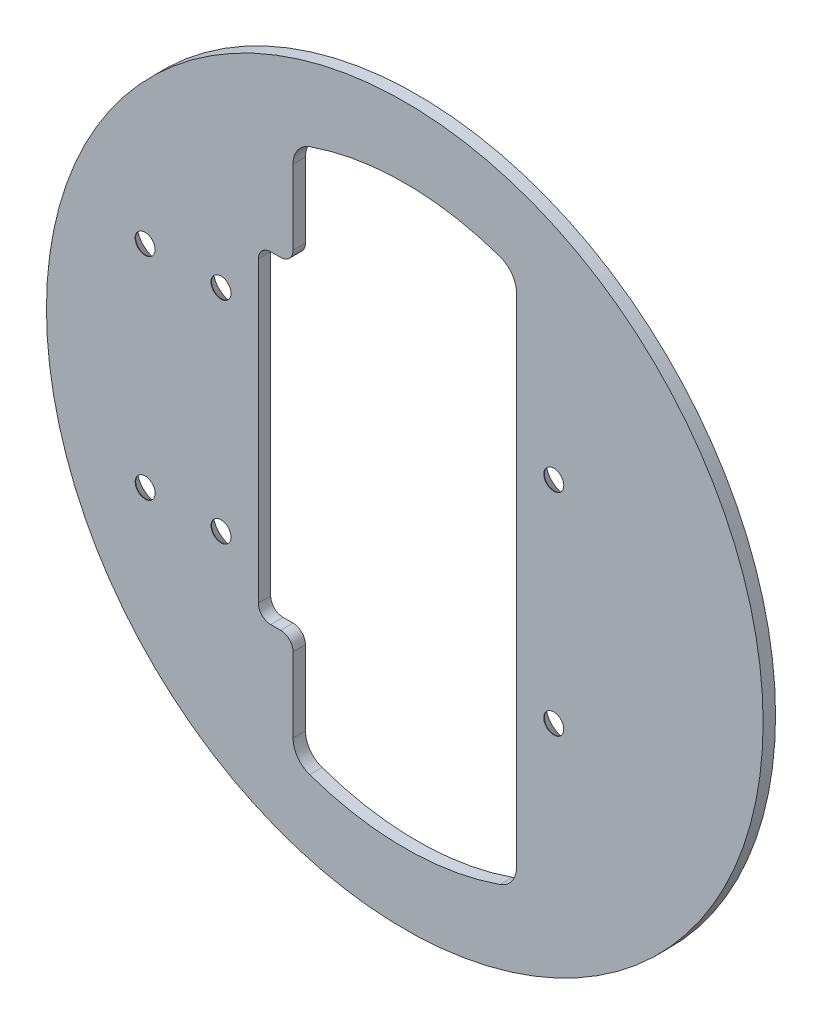
ISO-10303-21;
HEADER;
FILE_DESCRIPTION(('STEP AP214'),'2;1');
FILE_NAME('part.step','',(''),(''),'','','');
FILE_SCHEMA(('AUTOMOTIVE_DESIGN { 1 0 10303 214 1 1 1 1 }'));
ENDSEC;
DATA;
#1=APPLICATION_CONTEXT('core data for automotive mechanical design processes');
#2=APPLICATION_PROTOCOL_DEFINITION('international standard','automotive_design',2000,#1);
#3=PRODUCT_CONTEXT('',#1,'mechanical');
#4=PRODUCT('Part','Part','',(#3));
#5=PRODUCT_RELATED_PRODUCT_CATEGORY('part','',(#4));
#6=PRODUCT_DEFINITION_FORMATION('','',#4);
#7=PRODUCT_DEFINITION_CONTEXT('part definition',#1,'design');
#8=PRODUCT_DEFINITION('design','',#6,#7);
#9=PRODUCT_DEFINITION_SHAPE('','',#8);
#10=(LENGTH_UNIT() NAMED_UNIT(*) SI_UNIT(.MILLI.,.METRE.));
#11=(NAMED_UNIT(*) PLANE_ANGLE_UNIT() SI_UNIT($,.RADIAN.));
#12=(NAMED_UNIT(*) SI_UNIT($,.STERADIAN.) SOLID_ANGLE_UNIT());
#13=UNCERTAINTY_MEASURE_WITH_UNIT(LENGTH_MEASURE(1.E-05),#10,'distance_accuracy_value','');
#14=(GEOMETRIC_REPRESENTATION_CONTEXT(3) GLOBAL_UNCERTAINTY_ASSIGNED_CONTEXT((#13)) GLOBAL_UNIT_ASSIGNED_CONTEXT((#10,
#11,#12)) REPRESENTATION_CONTEXT('',''));
#15=CARTESIAN_POINT('',(0.,0.,0.));
#16=DIRECTION('',(0.,0.,1.));
#17=DIRECTION('',(1.,0.,0.));
#18=AXIS2_PLACEMENT_3D('',#15,#16,#17);
#19=CARTESIAN_POINT('',(0.,25.4,0.));
#20=DIRECTION('',(0.,0.,-1.));
#21=DIRECTION('',(-1.,0.,0.));
#22=AXIS2_PLACEMENT_3D('',#19,#20,#21);
#23=PLANE('',#22);
#24=CARTESIAN_POINT('',(0.,25.4,0.));
#25=DIRECTION('',(0.,0.,1.));
#26=DIRECTION('',(1.,0.,0.));
#27=AXIS2_PLACEMENT_3D('',#24,#25,#26);
#28=CIRCLE('',#27,73.66);
#29=CARTESIAN_POINT('',(-24.3216981132075,-44.1287753443853,0.));
#30=VERTEX_POINT('',#29);
#31=CARTESIAN_POINT('',(24.3216981132076,-44.1287753443853,0.));
#32=VERTEX_POINT('',#31);
#33=EDGE_CURVE('E230',#30,#32,#28,.T.);
#34=ORIENTED_EDGE('',*,*,#33,.T.);
#35=CARTESIAN_POINT('',(22.225,-38.1349154009038,0.));
#36=DIRECTION('',(0.,0.,1.));
#37=DIRECTION('',(1.,0.,0.));
#38=AXIS2_PLACEMENT_3D('',#35,#36,#37);
#39=CIRCLE('',#38,6.35);
#40=CARTESIAN_POINT('',(28.575,-38.1349154009038,0.));
#41=VERTEX_POINT('',#40);
#42=EDGE_CURVE('E148',#32,#41,#39,.T.);
#43=ORIENTED_EDGE('',*,*,#42,.T.);
#44=DIRECTION('',(0.,1.,0.));
#45=VECTOR('',#44,1.);
#46=CARTESIAN_POINT('',(28.575,-28.448,0.));
#47=LINE('',#46,#45);
#48=CARTESIAN_POINT('',(28.575,88.9349154009038,0.));
#49=VERTEX_POINT('',#48);
#50=EDGE_CURVE('E142',#41,#49,#47,.T.);
#51=ORIENTED_EDGE('',*,*,#50,.T.);
#52=CARTESIAN_POINT('',(22.225,88.9349154009038,0.));
#53=DIRECTION('',(0.,0.,1.));
#54=DIRECTION('',(1.,0.,0.));
#55=AXIS2_PLACEMENT_3D('',#52,#53,#54);
#56=CIRCLE('',#55,6.35);
#57=CARTESIAN_POINT('',(24.3216981132075,94.9287753443853,0.));
#58=VERTEX_POINT('',#57);
#59=EDGE_CURVE('E130',#49,#58,#56,.T.);
#60=ORIENTED_EDGE('',*,*,#59,.T.);
#61=CARTESIAN_POINT('',(0.,25.4,0.));
#62=DIRECTION('',(0.,0.,1.));
#63=DIRECTION('',(1.,0.,0.));
#64=AXIS2_PLACEMENT_3D('',#61,#62,#63);
#65=CIRCLE('',#64,73.66);
#66=CARTESIAN_POINT('',(-24.3216981132075,94.9287753443853,0.));
#67=VERTEX_POINT('',#66);
#68=EDGE_CURVE('E246',#58,#67,#65,.T.);
#69=ORIENTED_EDGE('',*,*,#68,.T.);
#70=CARTESIAN_POINT('',(-22.225,88.9349154009038,0.));
#71=DIRECTION('',(0.,0.,1.));
#72=DIRECTION('',(1.,0.,0.));
#73=AXIS2_PLACEMENT_3D('',#70,#71,#72);
#74=CIRCLE('',#73,6.35);
#75=CARTESIAN_POINT('',(-28.575,88.9349154009038,0.));
#76=VERTEX_POINT('',#75);
#77=EDGE_CURVE('E243',#67,#76,#74,.T.);
#78=ORIENTED_EDGE('',*,*,#77,.T.);
#79=DIRECTION('',(0.,1.,0.));
#80=VECTOR('',#79,1.);
#81=CARTESIAN_POINT('',(-28.575,69.8627,0.));
#82=LINE('',#81,#80);
#83=CARTESIAN_POINT('',(-28.575,69.8627,0.));
#84=VERTEX_POINT('',#83);
#85=EDGE_CURVE('E171',#76,#84,#82,.F.);
#86=ORIENTED_EDGE('',*,*,#85,.T.);
#87=CARTESIAN_POINT('',(-31.75,69.8627,0.));
#88=DIRECTION('',(0.,0.,1.));
#89=DIRECTION('',(1.,0.,0.));
#90=AXIS2_PLACEMENT_3D('',#87,#88,#89);
#91=CIRCLE('',#90,3.175);
#92=CARTESIAN_POINT('',(-31.75,66.6877,0.));
#93=VERTEX_POINT('',#92);
#94=EDGE_CURVE('E173',#93,#84,#91,.T.);
#95=ORIENTED_EDGE('',*,*,#94,.F.);
#96=DIRECTION('',(1.,0.,0.));
#97=VECTOR('',#96,1.);
#98=CARTESIAN_POINT('',(-34.29,66.6877,0.));
#99=LINE('',#98,#97);
#100=CARTESIAN_POINT('',(-34.29,66.6877,0.));
#101=VERTEX_POINT('',#100);
#102=EDGE_CURVE('E167',#93,#101,#99,.F.);
#103=ORIENTED_EDGE('',*,*,#102,.T.);
#104=CARTESIAN_POINT('',(-34.29,63.5127,0.));
#105=DIRECTION('',(0.,0.,1.));
#106=DIRECTION('',(1.,0.,0.));
#107=AXIS2_PLACEMENT_3D('',#104,#105,#106);
#108=CIRCLE('',#107,3.175);
#109=CARTESIAN_POINT('',(-37.465,63.5127,0.));
#110=VERTEX_POINT('',#109);
#111=EDGE_CURVE('E239',#101,#110,#108,.T.);
#112=ORIENTED_EDGE('',*,*,#111,.T.);
#113=DIRECTION('',(0.,1.,0.));
#114=VECTOR('',#113,1.);
#115=CARTESIAN_POINT('',(-37.465,-12.7,0.));
#116=LINE('',#115,#114);
#117=CARTESIAN_POINT('',(-37.465,-12.7,0.));
#118=VERTEX_POINT('',#117);
#119=EDGE_CURVE('E163',#110,#118,#116,.F.);
#120=ORIENTED_EDGE('',*,*,#119,.T.);
#121=CARTESIAN_POINT('',(-34.29,-12.7,0.));
#122=DIRECTION('',(0.,0.,1.));
#123=DIRECTION('',(1.,0.,0.));
#124=AXIS2_PLACEMENT_3D('',#121,#122,#123);
#125=CIRCLE('',#124,3.17499999999997);
#126=CARTESIAN_POINT('',(-34.29,-15.875,0.));
#127=VERTEX_POINT('',#126);
#128=EDGE_CURVE('E237',#118,#127,#125,.T.);
#129=ORIENTED_EDGE('',*,*,#128,.T.);
#130=DIRECTION('',(1.,0.,0.));
#131=VECTOR('',#130,1.);
#132=CARTESIAN_POINT('',(-31.75,-15.875,0.));
#133=LINE('',#132,#131);
#134=CARTESIAN_POINT('',(-31.75,-15.875,0.));
#135=VERTEX_POINT('',#134);
#136=EDGE_CURVE('E158',#127,#135,#133,.T.);
#137=ORIENTED_EDGE('',*,*,#136,.T.);
#138=CARTESIAN_POINT('',(-31.75,-19.05,0.));
#139=DIRECTION('',(0.,0.,1.));
#140=DIRECTION('',(1.,0.,0.));
#141=AXIS2_PLACEMENT_3D('',#138,#139,#140);
#142=CIRCLE('',#141,3.175);
#143=CARTESIAN_POINT('',(-28.5749999999999,-19.05,0.));
#144=VERTEX_POINT('',#143);
#145=EDGE_CURVE('E161',#144,#135,#142,.T.);
#146=ORIENTED_EDGE('',*,*,#145,.F.);
#147=DIRECTION('',(0.,1.,0.));
#148=VECTOR('',#147,1.);
#149=CARTESIAN_POINT('',(-28.5749999999999,-38.1349154009038,0.));
#150=LINE('',#149,#148);
#151=CARTESIAN_POINT('',(-28.5749999999999,-38.1349154009038,0.));
#152=VERTEX_POINT('',#151);
#153=EDGE_CURVE('E154',#144,#152,#150,.F.);
#154=ORIENTED_EDGE('',*,*,#153,.T.);
#155=CARTESIAN_POINT('',(-22.2249999999999,-38.1349154009038,0.));
#156=DIRECTION('',(0.,0.,1.));
#157=DIRECTION('',(1.,0.,0.));
#158=AXIS2_PLACEMENT_3D('',#155,#156,#157);
#159=CIRCLE('',#158,6.35);
#160=EDGE_CURVE('E233',#152,#30,#159,.T.);
#161=ORIENTED_EDGE('',*,*,#160,.T.);
#162=EDGE_LOOP('',(#34,#43,#51,#60,#69,#78,#86,#95,#103,#112,#120,#129,#137,#146,#154,#161));
#163=FACE_BOUND('',#162,.T.);
#164=CARTESIAN_POINT('',(38.1,-1.5875,0.));
#165=DIRECTION('',(0.,0.,-1.));
#166=DIRECTION('',(-1.,0.,0.));
#167=AXIS2_PLACEMENT_3D('',#164,#165,#166);
#168=CIRCLE('',#167,5.207);
#169=CARTESIAN_POINT('',(32.893,-1.5875,0.));
#170=VERTEX_POINT('',#169);
#171=EDGE_CURVE('E253',#170,#170,#168,.F.);
#172=ORIENTED_EDGE('',*,*,#171,.T.);
#173=EDGE_LOOP('',(#172));
#174=FACE_BOUND('',#173,.T.);
#175=CARTESIAN_POINT('',(38.1,52.3875,0.));
#176=DIRECTION('',(0.,0.,-1.));
#177=DIRECTION('',(-1.,0.,0.));
#178=AXIS2_PLACEMENT_3D('',#175,#176,#177);
#179=CIRCLE('',#178,5.207);
#180=CARTESIAN_POINT('',(32.893,52.3875,0.));
#181=VERTEX_POINT('',#180);
#182=EDGE_CURVE('E250',#181,#181,#179,.F.);
#183=ORIENTED_EDGE('',*,*,#182,.T.);
#184=EDGE_LOOP('',(#183));
#185=FACE_BOUND('',#184,.T.);
#186=CARTESIAN_POINT('',(-46.99,-1.58750000000003,0.));
#187=DIRECTION('',(0.,0.,-1.));
#188=DIRECTION('',(-1.,0.,0.));
#189=AXIS2_PLACEMENT_3D('',#186,#187,#188);
#190=CIRCLE('',#189,5.207);
#191=CARTESIAN_POINT('',(-52.197,-1.58750000000003,0.));
#192=VERTEX_POINT('',#191);
#193=EDGE_CURVE('E256',#192,#192,#190,.F.);
#194=ORIENTED_EDGE('',*,*,#193,.T.);
#195=EDGE_LOOP('',(#194));
#196=FACE_BOUND('',#195,.T.);
#197=CARTESIAN_POINT('',(-46.99,52.3875,0.));
#198=DIRECTION('',(0.,0.,-1.));
#199=DIRECTION('',(-1.,0.,0.));
#200=AXIS2_PLACEMENT_3D('',#197,#198,#199);
#201=CIRCLE('',#200,5.207);
#202=CARTESIAN_POINT('',(-52.197,52.3875,0.));
#203=VERTEX_POINT('',#202);
#204=EDGE_CURVE('E259',#203,#203,#201,.F.);
#205=ORIENTED_EDGE('',*,*,#204,.T.);
#206=EDGE_LOOP('',(#205));
#207=FACE_BOUND('',#206,.T.);
#208=CARTESIAN_POINT('',(-66.3956,52.3875,0.));
#209=DIRECTION('',(0.,0.,-1.));
#210=DIRECTION('',(-1.,0.,0.));
#211=AXIS2_PLACEMENT_3D('',#208,#209,#210);
#212=CIRCLE('',#211,5.20699999999998);
#213=CARTESIAN_POINT('',(-71.6026,52.3875,0.));
#214=VERTEX_POINT('',#213);
#215=EDGE_CURVE('E261',#214,#214,#212,.F.);
#216=ORIENTED_EDGE('',*,*,#215,.T.);
#217=EDGE_LOOP('',(#216));
#218=FACE_BOUND('',#217,.T.);
#219=CARTESIAN_POINT('',(-66.3956,-1.5875,0.));
#220=DIRECTION('',(0.,0.,-1.));
#221=DIRECTION('',(-1.,0.,0.));
#222=AXIS2_PLACEMENT_3D('',#219,#220,#221);
#223=CIRCLE('',#222,5.20699999999998);
#224=CARTESIAN_POINT('',(-71.6026,-1.5875,0.));
#225=VERTEX_POINT('',#224);
#226=EDGE_CURVE('E21',#225,#225,#223,.F.);
#227=ORIENTED_EDGE('',*,*,#226,.T.);
#228=EDGE_LOOP('',(#227));
#229=FACE_BOUND('',#228,.T.);
#230=CARTESIAN_POINT('',(0.,25.4,0.));
#231=DIRECTION('',(0.,0.,1.));
#232=DIRECTION('',(1.,0.,0.));
#233=AXIS2_PLACEMENT_3D('',#230,#231,#232);
#234=CIRCLE('',#233,91.6305);
#235=CARTESIAN_POINT('',(91.6305,25.4,0.));
#236=VERTEX_POINT('',#235);
#237=EDGE_CURVE('E139',#236,#236,#234,.T.);
#238=ORIENTED_EDGE('',*,*,#237,.F.);
#239=EDGE_LOOP('',(#238));
#240=FACE_BOUND('',#239,.T.);
#241=ADVANCED_FACE('F17',(#163,#174,#185,#196,#207,#218,#229,#240),#23,.T.);
#242=CARTESIAN_POINT('',(-66.3956,-1.5875,0.));
#243=DIRECTION('',(0.,0.,-1.));
#244=DIRECTION('',(-1.,0.,0.));
#245=AXIS2_PLACEMENT_3D('',#242,#243,#244);
#246=CONICAL_SURFACE('',#245,5.207,0.715584993317677);
#247=CARTESIAN_POINT('',(-66.3956,-1.5875,3.05342286328671));
#248=DIRECTION('',(0.,0.,1.));
#249=DIRECTION('',(1.,0.,0.));
#250=AXIS2_PLACEMENT_3D('',#247,#248,#249);
#251=CIRCLE('',#250,2.5527);
#252=CARTESIAN_POINT('',(-63.8429,-1.5875,3.05342286328671));
#253=VERTEX_POINT('',#252);
#254=EDGE_CURVE('E144',#253,#253,#251,.T.);
#255=ORIENTED_EDGE('',*,*,#254,.T.);
#256=EDGE_LOOP('',(#255));
#257=FACE_BOUND('',#256,.T.);
#258=ORIENTED_EDGE('',*,*,#226,.F.);
#259=EDGE_LOOP('',(#258));
#260=FACE_BOUND('',#259,.T.);
#261=ADVANCED_FACE('F270',(#257,#260),#246,.F.);
#262=CARTESIAN_POINT('',(-66.3956,52.3875,0.));
#263=DIRECTION('',(0.,0.,-1.));
#264=DIRECTION('',(-1.,0.,0.));
#265=AXIS2_PLACEMENT_3D('',#262,#263,#264);
#266=CONICAL_SURFACE('',#265,5.207,0.715584993317677);
#267=CARTESIAN_POINT('',(-66.3956,52.3875,3.05342286328671));
#268=DIRECTION('',(0.,0.,1.));
#269=DIRECTION('',(1.,0.,0.));
#270=AXIS2_PLACEMENT_3D('',#267,#268,#269);
#271=CIRCLE('',#270,2.5527);
#272=CARTESIAN_POINT('',(-63.8429,52.3875,3.05342286328671));
#273=VERTEX_POINT('',#272);
#274=EDGE_CURVE('E418',#273,#273,#271,.T.);
#275=ORIENTED_EDGE('',*,*,#274,.T.);
#276=EDGE_LOOP('',(#275));
#277=FACE_BOUND('',#276,.T.);
#278=ORIENTED_EDGE('',*,*,#215,.F.);
#279=EDGE_LOOP('',(#278));
#280=FACE_BOUND('',#279,.T.);
#281=ADVANCED_FACE('F272',(#277,#280),#266,.F.);
#282=CARTESIAN_POINT('',(-46.99,52.3875,0.));
#283=DIRECTION('',(0.,0.,-1.));
#284=DIRECTION('',(-1.,0.,0.));
#285=AXIS2_PLACEMENT_3D('',#282,#283,#284);
#286=CONICAL_SURFACE('',#285,5.207,0.715584993317677);
#287=CARTESIAN_POINT('',(-46.99,52.3875,3.05342286328671));
#288=DIRECTION('',(0.,0.,1.));
#289=DIRECTION('',(1.,0.,0.));
#290=AXIS2_PLACEMENT_3D('',#287,#288,#289);
#291=CIRCLE('',#290,2.5527);
#292=CARTESIAN_POINT('',(-44.4373,52.3875,3.05342286328671));
#293=VERTEX_POINT('',#292);
#294=EDGE_CURVE('E415',#293,#293,#291,.T.);
#295=ORIENTED_EDGE('',*,*,#294,.T.);
#296=EDGE_LOOP('',(#295));
#297=FACE_BOUND('',#296,.T.);
#298=ORIENTED_EDGE('',*,*,#204,.F.);
#299=EDGE_LOOP('',(#298));
#300=FACE_BOUND('',#299,.T.);
#301=ADVANCED_FACE('F280',(#297,#300),#286,.F.);
#302=CARTESIAN_POINT('',(-46.99,-1.58750000000003,0.));
#303=DIRECTION('',(0.,0.,-1.));
#304=DIRECTION('',(-1.,0.,0.));
#305=AXIS2_PLACEMENT_3D('',#302,#303,#304);
#306=CONICAL_SURFACE('',#305,5.207,0.715584993317677);
#307=CARTESIAN_POINT('',(-46.99,-1.58750000000003,3.05342286328671));
#308=DIRECTION('',(0.,0.,1.));
#309=DIRECTION('',(1.,0.,0.));
#310=AXIS2_PLACEMENT_3D('',#307,#308,#309);
#311=CIRCLE('',#310,2.5527);
#312=CARTESIAN_POINT('',(-44.4373,-1.58750000000003,3.05342286328671));
#313=VERTEX_POINT('',#312);
#314=EDGE_CURVE('E417',#313,#313,#311,.T.);
#315=ORIENTED_EDGE('',*,*,#314,.T.);
#316=EDGE_LOOP('',(#315));
#317=FACE_BOUND('',#316,.T.);
#318=ORIENTED_EDGE('',*,*,#193,.F.);
#319=EDGE_LOOP('',(#318));
#320=FACE_BOUND('',#319,.T.);
#321=ADVANCED_FACE('F393',(#317,#320),#306,.F.);
#322=CARTESIAN_POINT('',(38.1,-1.5875,0.));
#323=DIRECTION('',(0.,0.,-1.));
#324=DIRECTION('',(-1.,0.,0.));
#325=AXIS2_PLACEMENT_3D('',#322,#323,#324);
#326=CONICAL_SURFACE('',#325,5.207,0.715584993317677);
#327=CARTESIAN_POINT('',(38.1,-1.5875,3.05342286328671));
#328=DIRECTION('',(0.,0.,1.));
#329=DIRECTION('',(1.,0.,0.));
#330=AXIS2_PLACEMENT_3D('',#327,#328,#329);
#331=CIRCLE('',#330,2.5527);
#332=CARTESIAN_POINT('',(40.6527,-1.5875,3.05342286328671));
#333=VERTEX_POINT('',#332);
#334=EDGE_CURVE('E421',#333,#333,#331,.T.);
#335=ORIENTED_EDGE('',*,*,#334,.T.);
#336=EDGE_LOOP('',(#335));
#337=FACE_BOUND('',#336,.T.);
#338=ORIENTED_EDGE('',*,*,#171,.F.);
#339=EDGE_LOOP('',(#338));
#340=FACE_BOUND('',#339,.T.);
#341=ADVANCED_FACE('F384',(#337,#340),#326,.F.);
#342=CARTESIAN_POINT('',(38.1,52.3875,0.));
#343=DIRECTION('',(0.,0.,-1.));
#344=DIRECTION('',(-1.,0.,0.));
#345=AXIS2_PLACEMENT_3D('',#342,#343,#344);
#346=CONICAL_SURFACE('',#345,5.207,0.715584993317677);
#347=CARTESIAN_POINT('',(38.1,52.3875,3.05342286328671));
#348=DIRECTION('',(0.,0.,1.));
#349=DIRECTION('',(1.,0.,0.));
#350=AXIS2_PLACEMENT_3D('',#347,#348,#349);
#351=CIRCLE('',#350,2.5527);
#352=CARTESIAN_POINT('',(40.6527,52.3875,3.05342286328671));
#353=VERTEX_POINT('',#352);
#354=EDGE_CURVE('E227',#353,#353,#351,.T.);
#355=ORIENTED_EDGE('',*,*,#354,.T.);
#356=EDGE_LOOP('',(#355));
#357=FACE_BOUND('',#356,.T.);
#358=ORIENTED_EDGE('',*,*,#182,.F.);
#359=EDGE_LOOP('',(#358));
#360=FACE_BOUND('',#359,.T.);
#361=ADVANCED_FACE('F19',(#357,#360),#346,.F.);
#362=CARTESIAN_POINT('',(0.,25.4,0.));
#363=DIRECTION('',(0.,0.,1.));
#364=DIRECTION('',(1.,0.,0.));
#365=AXIS2_PLACEMENT_3D('',#362,#363,#364);
#366=CYLINDRICAL_SURFACE('',#365,91.6305);
#367=ORIENTED_EDGE('',*,*,#237,.T.);
#368=EDGE_LOOP('',(#367));
#369=FACE_BOUND('',#368,.T.);
#370=CARTESIAN_POINT('',(0.,25.4,3.175));
#371=DIRECTION('',(0.,0.,1.));
#372=DIRECTION('',(1.,0.,0.));
#373=AXIS2_PLACEMENT_3D('',#370,#371,#372);
#374=CIRCLE('',#373,91.6305);
#375=CARTESIAN_POINT('',(91.6305,25.4,3.175));
#376=VERTEX_POINT('',#375);
#377=EDGE_CURVE('E224',#376,#376,#374,.F.);
#378=ORIENTED_EDGE('',*,*,#377,.T.);
#379=EDGE_LOOP('',(#378));
#380=FACE_BOUND('',#379,.T.);
#381=ADVANCED_FACE('F378',(#369,#380),#366,.T.);
#382=CARTESIAN_POINT('',(22.225,88.9349154009038,0.));
#383=DIRECTION('',(0.,0.,1.));
#384=DIRECTION('',(1.,0.,0.));
#385=AXIS2_PLACEMENT_3D('',#382,#383,#384);
#386=CYLINDRICAL_SURFACE('',#385,6.35);
#387=DIRECTION('',(0.,0.,1.));
#388=VECTOR('',#387,1.);
#389=CARTESIAN_POINT('',(24.3216981132075,94.9287753443853,0.));
#390=LINE('',#389,#388);
#391=CARTESIAN_POINT('',(24.3216981132075,94.9287753443853,3.175));
#392=VERTEX_POINT('',#391);
#393=EDGE_CURVE('E135',#392,#58,#390,.F.);
#394=ORIENTED_EDGE('',*,*,#393,.T.);
#395=ORIENTED_EDGE('',*,*,#59,.F.);
#396=DIRECTION('',(0.,0.,-1.));
#397=VECTOR('',#396,1.);
#398=CARTESIAN_POINT('',(28.575,88.9349154009038,0.));
#399=LINE('',#398,#397);
#400=CARTESIAN_POINT('',(28.575,88.9349154009038,3.175));
#401=VERTEX_POINT('',#400);
#402=EDGE_CURVE('E134',#49,#401,#399,.F.);
#403=ORIENTED_EDGE('',*,*,#402,.T.);
#404=CARTESIAN_POINT('',(22.225,88.9349154009038,3.175));
#405=DIRECTION('',(0.,0.,1.));
#406=DIRECTION('',(1.,0.,0.));
#407=AXIS2_PLACEMENT_3D('',#404,#405,#406);
#408=CIRCLE('',#407,6.35);
#409=EDGE_CURVE('E222',#401,#392,#408,.T.);
#410=ORIENTED_EDGE('',*,*,#409,.T.);
#411=EDGE_LOOP('',(#394,#395,#403,#410));
#412=FACE_BOUND('',#411,.T.);
#413=ADVANCED_FACE('F132',(#412),#386,.F.);
#414=CARTESIAN_POINT('',(0.,25.4,0.));
#415=DIRECTION('',(0.,0.,1.));
#416=DIRECTION('',(1.,0.,0.));
#417=AXIS2_PLACEMENT_3D('',#414,#415,#416);
#418=CYLINDRICAL_SURFACE('',#417,73.66);
#419=DIRECTION('',(0.,0.,1.));
#420=VECTOR('',#419,1.);
#421=CARTESIAN_POINT('',(-24.3216981132075,94.9287753443853,0.));
#422=LINE('',#421,#420);
#423=CARTESIAN_POINT('',(-24.3216981132075,94.9287753443853,3.175));
#424=VERTEX_POINT('',#423);
#425=EDGE_CURVE('E245',#424,#67,#422,.F.);
#426=ORIENTED_EDGE('',*,*,#425,.T.);
#427=ORIENTED_EDGE('',*,*,#68,.F.);
#428=ORIENTED_EDGE('',*,*,#393,.F.);
#429=CARTESIAN_POINT('',(0.,25.4,3.175));
#430=DIRECTION('',(0.,0.,1.));
#431=DIRECTION('',(1.,0.,0.));
#432=AXIS2_PLACEMENT_3D('',#429,#430,#431);
#433=CIRCLE('',#432,73.66);
#434=EDGE_CURVE('E219',#392,#424,#433,.T.);
#435=ORIENTED_EDGE('',*,*,#434,.T.);
#436=EDGE_LOOP('',(#426,#427,#428,#435));
#437=FACE_BOUND('',#436,.T.);
#438=ADVANCED_FACE('F371',(#437),#418,.F.);
#439=CARTESIAN_POINT('',(-22.225,88.9349154009038,0.));
#440=DIRECTION('',(0.,0.,1.));
#441=DIRECTION('',(1.,0.,0.));
#442=AXIS2_PLACEMENT_3D('',#439,#440,#441);
#443=CYLINDRICAL_SURFACE('',#442,6.35);
#444=DIRECTION('',(0.,0.,1.));
#445=VECTOR('',#444,1.);
#446=CARTESIAN_POINT('',(-28.575,88.9349154009038,0.));
#447=LINE('',#446,#445);
#448=CARTESIAN_POINT('',(-28.575,88.9349154009038,3.175));
#449=VERTEX_POINT('',#448);
#450=EDGE_CURVE('E174',#449,#76,#447,.F.);
#451=ORIENTED_EDGE('',*,*,#450,.T.);
#452=ORIENTED_EDGE('',*,*,#77,.F.);
#453=ORIENTED_EDGE('',*,*,#425,.F.);
#454=CARTESIAN_POINT('',(-22.225,88.9349154009038,3.175));
#455=DIRECTION('',(0.,0.,1.));
#456=DIRECTION('',(1.,0.,0.));
#457=AXIS2_PLACEMENT_3D('',#454,#455,#456);
#458=CIRCLE('',#457,6.35);
#459=EDGE_CURVE('E216',#424,#449,#458,.T.);
#460=ORIENTED_EDGE('',*,*,#459,.T.);
#461=EDGE_LOOP('',(#451,#452,#453,#460));
#462=FACE_BOUND('',#461,.T.);
#463=ADVANCED_FACE('F367',(#462),#443,.F.);
#464=CARTESIAN_POINT('',(-28.575,69.8627,0.));
#465=DIRECTION('',(-1.,0.,0.));
#466=DIRECTION('',(0.,0.,1.));
#467=AXIS2_PLACEMENT_3D('',#464,#465,#466);
#468=PLANE('',#467);
#469=DIRECTION('',(0.,0.,1.));
#470=VECTOR('',#469,1.);
#471=CARTESIAN_POINT('',(-28.575,69.8627,0.));
#472=LINE('',#471,#470);
#473=CARTESIAN_POINT('',(-28.575,69.8627,3.175));
#474=VERTEX_POINT('',#473);
#475=EDGE_CURVE('E242',#84,#474,#472,.T.);
#476=ORIENTED_EDGE('',*,*,#475,.F.);
#477=ORIENTED_EDGE('',*,*,#85,.F.);
#478=ORIENTED_EDGE('',*,*,#450,.F.);
#479=DIRECTION('',(0.,1.,0.));
#480=VECTOR('',#479,1.);
#481=CARTESIAN_POINT('',(-28.575,25.4,3.175));
#482=LINE('',#481,#480);
#483=EDGE_CURVE('E215',#449,#474,#482,.F.);
#484=ORIENTED_EDGE('',*,*,#483,.T.);
#485=EDGE_LOOP('',(#476,#477,#478,#484));
#486=FACE_BOUND('',#485,.T.);
#487=ADVANCED_FACE('F363',(#486),#468,.F.);
#488=CARTESIAN_POINT('',(-31.75,69.8627,0.));
#489=DIRECTION('',(0.,0.,1.));
#490=DIRECTION('',(1.,0.,0.));
#491=AXIS2_PLACEMENT_3D('',#488,#489,#490);
#492=CYLINDRICAL_SURFACE('',#491,3.175);
#493=ORIENTED_EDGE('',*,*,#94,.T.);
#494=ORIENTED_EDGE('',*,*,#475,.T.);
#495=CARTESIAN_POINT('',(-31.75,69.8627,3.175));
#496=DIRECTION('',(0.,0.,1.));
#497=DIRECTION('',(1.,0.,0.));
#498=AXIS2_PLACEMENT_3D('',#495,#496,#497);
#499=CIRCLE('',#498,3.175);
#500=CARTESIAN_POINT('',(-31.75,66.6877,3.175));
#501=VERTEX_POINT('',#500);
#502=EDGE_CURVE('E212',#474,#501,#499,.F.);
#503=ORIENTED_EDGE('',*,*,#502,.T.);
#504=DIRECTION('',(0.,0.,1.));
#505=VECTOR('',#504,1.);
#506=CARTESIAN_POINT('',(-31.75,66.6877,0.));
#507=LINE('',#506,#505);
#508=EDGE_CURVE('E170',#501,#93,#507,.F.);
#509=ORIENTED_EDGE('',*,*,#508,.T.);
#510=EDGE_LOOP('',(#493,#494,#503,#509));
#511=FACE_BOUND('',#510,.T.);
#512=ADVANCED_FACE('F359',(#511),#492,.T.);
#513=CARTESIAN_POINT('',(-34.29,66.6877,0.));
#514=DIRECTION('',(0.,1.,0.));
#515=DIRECTION('',(0.,0.,1.));
#516=AXIS2_PLACEMENT_3D('',#513,#514,#515);
#517=PLANE('',#516);
#518=DIRECTION('',(0.,0.,1.));
#519=VECTOR('',#518,1.);
#520=CARTESIAN_POINT('',(-34.29,66.6876999999999,0.));
#521=LINE('',#520,#519);
#522=CARTESIAN_POINT('',(-34.29,66.6877,3.175));
#523=VERTEX_POINT('',#522);
#524=EDGE_CURVE('E169',#523,#101,#521,.F.);
#525=ORIENTED_EDGE('',*,*,#524,.T.);
#526=ORIENTED_EDGE('',*,*,#102,.F.);
#527=ORIENTED_EDGE('',*,*,#508,.F.);
#528=DIRECTION('',(-1.,0.,0.));
#529=VECTOR('',#528,1.);
#530=CARTESIAN_POINT('',(0.,66.6877,3.175));
#531=LINE('',#530,#529);
#532=EDGE_CURVE('E211',#501,#523,#531,.T.);
#533=ORIENTED_EDGE('',*,*,#532,.T.);
#534=EDGE_LOOP('',(#525,#526,#527,#533));
#535=FACE_BOUND('',#534,.T.);
#536=ADVANCED_FACE('F355',(#535),#517,.F.);
#537=CARTESIAN_POINT('',(-34.29,63.5127,0.));
#538=DIRECTION('',(0.,0.,1.));
#539=DIRECTION('',(1.,0.,0.));
#540=AXIS2_PLACEMENT_3D('',#537,#538,#539);
#541=CYLINDRICAL_SURFACE('',#540,3.175);
#542=DIRECTION('',(0.,0.,1.));
#543=VECTOR('',#542,1.);
#544=CARTESIAN_POINT('',(-37.465,63.5127,0.));
#545=LINE('',#544,#543);
#546=CARTESIAN_POINT('',(-37.465,63.5127,3.175));
#547=VERTEX_POINT('',#546);
#548=EDGE_CURVE('E166',#547,#110,#545,.F.);
#549=ORIENTED_EDGE('',*,*,#548,.T.);
#550=ORIENTED_EDGE('',*,*,#111,.F.);
#551=ORIENTED_EDGE('',*,*,#524,.F.);
#552=CARTESIAN_POINT('',(-34.29,63.5127,3.175));
#553=DIRECTION('',(0.,0.,1.));
#554=DIRECTION('',(1.,0.,0.));
#555=AXIS2_PLACEMENT_3D('',#552,#553,#554);
#556=CIRCLE('',#555,3.175);
#557=EDGE_CURVE('E208',#523,#547,#556,.T.);
#558=ORIENTED_EDGE('',*,*,#557,.T.);
#559=EDGE_LOOP('',(#549,#550,#551,#558));
#560=FACE_BOUND('',#559,.T.);
#561=ADVANCED_FACE('F351',(#560),#541,.F.);
#562=CARTESIAN_POINT('',(-37.465,-12.7,0.));
#563=DIRECTION('',(-1.,0.,0.));
#564=DIRECTION('',(0.,0.,1.));
#565=AXIS2_PLACEMENT_3D('',#562,#563,#564);
#566=PLANE('',#565);
#567=DIRECTION('',(0.,0.,1.));
#568=VECTOR('',#567,1.);
#569=CARTESIAN_POINT('',(-37.465,-12.7,0.));
#570=LINE('',#569,#568);
#571=CARTESIAN_POINT('',(-37.465,-12.7,3.175));
#572=VERTEX_POINT('',#571);
#573=EDGE_CURVE('E165',#572,#118,#570,.F.);
#574=ORIENTED_EDGE('',*,*,#573,.T.);
#575=ORIENTED_EDGE('',*,*,#119,.F.);
#576=ORIENTED_EDGE('',*,*,#548,.F.);
#577=DIRECTION('',(0.,1.,0.));
#578=VECTOR('',#577,1.);
#579=CARTESIAN_POINT('',(-37.465,25.4,3.175));
#580=LINE('',#579,#578);
#581=EDGE_CURVE('E207',#547,#572,#580,.F.);
#582=ORIENTED_EDGE('',*,*,#581,.T.);
#583=EDGE_LOOP('',(#574,#575,#576,#582));
#584=FACE_BOUND('',#583,.T.);
#585=ADVANCED_FACE('F347',(#584),#566,.F.);
#586=CARTESIAN_POINT('',(-34.29,-12.7,0.));
#587=DIRECTION('',(0.,0.,1.));
#588=DIRECTION('',(1.,0.,0.));
#589=AXIS2_PLACEMENT_3D('',#586,#587,#588);
#590=CYLINDRICAL_SURFACE('',#589,3.17499999999997);
#591=DIRECTION('',(0.,0.,-1.));
#592=VECTOR('',#591,1.);
#593=CARTESIAN_POINT('',(-34.29,-15.875,0.));
#594=LINE('',#593,#592);
#595=CARTESIAN_POINT('',(-34.29,-15.875,3.175));
#596=VERTEX_POINT('',#595);
#597=EDGE_CURVE('E162',#596,#127,#594,.T.);
#598=ORIENTED_EDGE('',*,*,#597,.T.);
#599=ORIENTED_EDGE('',*,*,#128,.F.);
#600=ORIENTED_EDGE('',*,*,#573,.F.);
#601=CARTESIAN_POINT('',(-34.29,-12.7,3.175));
#602=DIRECTION('',(0.,0.,1.));
#603=DIRECTION('',(1.,0.,0.));
#604=AXIS2_PLACEMENT_3D('',#601,#602,#603);
#605=CIRCLE('',#604,3.17499999999997);
#606=EDGE_CURVE('E204',#572,#596,#605,.T.);
#607=ORIENTED_EDGE('',*,*,#606,.T.);
#608=EDGE_LOOP('',(#598,#599,#600,#607));
#609=FACE_BOUND('',#608,.T.);
#610=ADVANCED_FACE('F343',(#609),#590,.F.);
#611=CARTESIAN_POINT('',(-31.75,-15.875,0.));
#612=DIRECTION('',(0.,-1.,0.));
#613=DIRECTION('',(0.,0.,-1.));
#614=AXIS2_PLACEMENT_3D('',#611,#612,#613);
#615=PLANE('',#614);
#616=DIRECTION('',(0.,0.,1.));
#617=VECTOR('',#616,1.);
#618=CARTESIAN_POINT('',(-31.75,-15.875,0.));
#619=LINE('',#618,#617);
#620=CARTESIAN_POINT('',(-31.75,-15.875,3.175));
#621=VERTEX_POINT('',#620);
#622=EDGE_CURVE('E236',#135,#621,#619,.T.);
#623=ORIENTED_EDGE('',*,*,#622,.F.);
#624=ORIENTED_EDGE('',*,*,#136,.F.);
#625=ORIENTED_EDGE('',*,*,#597,.F.);
#626=DIRECTION('',(-1.,0.,0.));
#627=VECTOR('',#626,1.);
#628=CARTESIAN_POINT('',(0.,-15.875,3.175));
#629=LINE('',#628,#627);
#630=EDGE_CURVE('E203',#596,#621,#629,.F.);
#631=ORIENTED_EDGE('',*,*,#630,.T.);
#632=EDGE_LOOP('',(#623,#624,#625,#631));
#633=FACE_BOUND('',#632,.T.);
#634=ADVANCED_FACE('F339',(#633),#615,.F.);
#635=CARTESIAN_POINT('',(-31.75,-19.05,0.));
#636=DIRECTION('',(0.,0.,1.));
#637=DIRECTION('',(1.,0.,0.));
#638=AXIS2_PLACEMENT_3D('',#635,#636,#637);
#639=CYLINDRICAL_SURFACE('',#638,3.175);
#640=ORIENTED_EDGE('',*,*,#145,.T.);
#641=ORIENTED_EDGE('',*,*,#622,.T.);
#642=CARTESIAN_POINT('',(-31.75,-19.05,3.175));
#643=DIRECTION('',(0.,0.,1.));
#644=DIRECTION('',(1.,0.,0.));
#645=AXIS2_PLACEMENT_3D('',#642,#643,#644);
#646=CIRCLE('',#645,3.175);
#647=CARTESIAN_POINT('',(-28.575,-19.05,3.175));
#648=VERTEX_POINT('',#647);
#649=EDGE_CURVE('E200',#621,#648,#646,.F.);
#650=ORIENTED_EDGE('',*,*,#649,.T.);
#651=DIRECTION('',(0.,0.,1.));
#652=VECTOR('',#651,1.);
#653=CARTESIAN_POINT('',(-28.5749999999999,-19.05,0.));
#654=LINE('',#653,#652);
#655=EDGE_CURVE('E157',#648,#144,#654,.F.);
#656=ORIENTED_EDGE('',*,*,#655,.T.);
#657=EDGE_LOOP('',(#640,#641,#650,#656));
#658=FACE_BOUND('',#657,.T.);
#659=ADVANCED_FACE('F335',(#658),#639,.T.);
#660=CARTESIAN_POINT('',(-28.5749999999999,-38.1349154009038,0.));
#661=DIRECTION('',(-1.,0.,0.));
#662=DIRECTION('',(0.,0.,1.));
#663=AXIS2_PLACEMENT_3D('',#660,#661,#662);
#664=PLANE('',#663);
#665=DIRECTION('',(0.,0.,1.));
#666=VECTOR('',#665,1.);
#667=CARTESIAN_POINT('',(-28.5749999999999,-38.1349154009038,0.));
#668=LINE('',#667,#666);
#669=CARTESIAN_POINT('',(-28.575,-38.1349154009038,3.175));
#670=VERTEX_POINT('',#669);
#671=EDGE_CURVE('E156',#670,#152,#668,.F.);
#672=ORIENTED_EDGE('',*,*,#671,.T.);
#673=ORIENTED_EDGE('',*,*,#153,.F.);
#674=ORIENTED_EDGE('',*,*,#655,.F.);
#675=DIRECTION('',(0.,1.,0.));
#676=VECTOR('',#675,1.);
#677=CARTESIAN_POINT('',(-28.575,25.4,3.175));
#678=LINE('',#677,#676);
#679=EDGE_CURVE('E199',#648,#670,#678,.F.);
#680=ORIENTED_EDGE('',*,*,#679,.T.);
#681=EDGE_LOOP('',(#672,#673,#674,#680));
#682=FACE_BOUND('',#681,.T.);
#683=ADVANCED_FACE('F331',(#682),#664,.F.);
#684=CARTESIAN_POINT('',(-22.2249999999999,-38.1349154009038,0.));
#685=DIRECTION('',(0.,0.,1.));
#686=DIRECTION('',(1.,0.,0.));
#687=AXIS2_PLACEMENT_3D('',#684,#685,#686);
#688=CYLINDRICAL_SURFACE('',#687,6.35);
#689=DIRECTION('',(0.,0.,1.));
#690=VECTOR('',#689,1.);
#691=CARTESIAN_POINT('',(-24.3216981132075,-44.1287753443853,0.));
#692=LINE('',#691,#690);
#693=CARTESIAN_POINT('',(-24.3216981132075,-44.1287753443853,3.175));
#694=VERTEX_POINT('',#693);
#695=EDGE_CURVE('E232',#694,#30,#692,.F.);
#696=ORIENTED_EDGE('',*,*,#695,.T.);
#697=ORIENTED_EDGE('',*,*,#160,.F.);
#698=ORIENTED_EDGE('',*,*,#671,.F.);
#699=CARTESIAN_POINT('',(-22.2249999999999,-38.1349154009038,3.175));
#700=DIRECTION('',(0.,0.,1.));
#701=DIRECTION('',(1.,0.,0.));
#702=AXIS2_PLACEMENT_3D('',#699,#700,#701);
#703=CIRCLE('',#702,6.35);
#704=EDGE_CURVE('E196',#670,#694,#703,.T.);
#705=ORIENTED_EDGE('',*,*,#704,.T.);
#706=EDGE_LOOP('',(#696,#697,#698,#705));
#707=FACE_BOUND('',#706,.T.);
#708=ADVANCED_FACE('F327',(#707),#688,.F.);
#709=CARTESIAN_POINT('',(0.,25.4,0.));
#710=DIRECTION('',(0.,0.,1.));
#711=DIRECTION('',(1.,0.,0.));
#712=AXIS2_PLACEMENT_3D('',#709,#710,#711);
#713=CYLINDRICAL_SURFACE('',#712,73.66);
#714=DIRECTION('',(0.,0.,1.));
#715=VECTOR('',#714,1.);
#716=CARTESIAN_POINT('',(24.3216981132076,-44.1287753443853,0.));
#717=LINE('',#716,#715);
#718=CARTESIAN_POINT('',(24.3216981132076,-44.1287753443853,3.175));
#719=VERTEX_POINT('',#718);
#720=EDGE_CURVE('E229',#719,#32,#717,.F.);
#721=ORIENTED_EDGE('',*,*,#720,.T.);
#722=ORIENTED_EDGE('',*,*,#33,.F.);
#723=ORIENTED_EDGE('',*,*,#695,.F.);
#724=CARTESIAN_POINT('',(0.,25.4,3.175));
#725=DIRECTION('',(0.,0.,1.));
#726=DIRECTION('',(1.,0.,0.));
#727=AXIS2_PLACEMENT_3D('',#724,#725,#726);
#728=CIRCLE('',#727,73.66);
#729=EDGE_CURVE('E193',#694,#719,#728,.T.);
#730=ORIENTED_EDGE('',*,*,#729,.T.);
#731=EDGE_LOOP('',(#721,#722,#723,#730));
#732=FACE_BOUND('',#731,.T.);
#733=ADVANCED_FACE('F323',(#732),#713,.F.);
#734=CARTESIAN_POINT('',(22.225,-38.1349154009038,0.));
#735=DIRECTION('',(0.,0.,1.));
#736=DIRECTION('',(1.,0.,0.));
#737=AXIS2_PLACEMENT_3D('',#734,#735,#736);
#738=CYLINDRICAL_SURFACE('',#737,6.35);
#739=DIRECTION('',(0.,0.,-1.));
#740=VECTOR('',#739,1.);
#741=CARTESIAN_POINT('',(28.575,-38.1349154009038,0.));
#742=LINE('',#741,#740);
#743=CARTESIAN_POINT('',(28.575,-38.1349154009038,3.175));
#744=VERTEX_POINT('',#743);
#745=EDGE_CURVE('E36',#744,#41,#742,.T.);
#746=ORIENTED_EDGE('',*,*,#745,.T.);
#747=ORIENTED_EDGE('',*,*,#42,.F.);
#748=ORIENTED_EDGE('',*,*,#720,.F.);
#749=CARTESIAN_POINT('',(22.225,-38.1349154009038,3.175));
#750=DIRECTION('',(0.,0.,1.));
#751=DIRECTION('',(1.,0.,0.));
#752=AXIS2_PLACEMENT_3D('',#749,#750,#751);
#753=CIRCLE('',#752,6.35);
#754=EDGE_CURVE('E190',#719,#744,#753,.T.);
#755=ORIENTED_EDGE('',*,*,#754,.T.);
#756=EDGE_LOOP('',(#746,#747,#748,#755));
#757=FACE_BOUND('',#756,.T.);
#758=ADVANCED_FACE('F320',(#757),#738,.F.);
#759=CARTESIAN_POINT('',(28.575,-28.448,0.));
#760=DIRECTION('',(1.,0.,0.));
#761=DIRECTION('',(0.,0.,-1.));
#762=AXIS2_PLACEMENT_3D('',#759,#760,#761);
#763=PLANE('',#762);
#764=ORIENTED_EDGE('',*,*,#402,.F.);
#765=ORIENTED_EDGE('',*,*,#50,.F.);
#766=ORIENTED_EDGE('',*,*,#745,.F.);
#767=DIRECTION('',(0.,1.,0.));
#768=VECTOR('',#767,1.);
#769=CARTESIAN_POINT('',(28.575,25.4,3.175));
#770=LINE('',#769,#768);
#771=EDGE_CURVE('E143',#744,#401,#770,.T.);
#772=ORIENTED_EDGE('',*,*,#771,.T.);
#773=EDGE_LOOP('',(#764,#765,#766,#772));
#774=FACE_BOUND('',#773,.T.);
#775=ADVANCED_FACE('F141',(#774),#763,.F.);
#776=CARTESIAN_POINT('',(-66.3956,-1.5875,0.));
#777=DIRECTION('',(0.,0.,1.));
#778=DIRECTION('',(1.,0.,0.));
#779=AXIS2_PLACEMENT_3D('',#776,#777,#778);
#780=CYLINDRICAL_SURFACE('',#779,2.5527);
#781=CARTESIAN_POINT('',(-66.3956,-1.5875,3.175));
#782=DIRECTION('',(0.,0.,1.));
#783=DIRECTION('',(1.,0.,0.));
#784=AXIS2_PLACEMENT_3D('',#781,#782,#783);
#785=CIRCLE('',#784,2.5527);
#786=CARTESIAN_POINT('',(-63.8429,-1.5875,3.175));
#787=VERTEX_POINT('',#786);
#788=EDGE_CURVE('E187',#787,#787,#785,.T.);
#789=ORIENTED_EDGE('',*,*,#788,.T.);
#790=EDGE_LOOP('',(#789));
#791=FACE_BOUND('',#790,.T.);
#792=ORIENTED_EDGE('',*,*,#254,.F.);
#793=EDGE_LOOP('',(#792));
#794=FACE_BOUND('',#793,.T.);
#795=ADVANCED_FACE('F313',(#791,#794),#780,.F.);
#796=CARTESIAN_POINT('',(-66.3956,52.3875,0.));
#797=DIRECTION('',(0.,0.,1.));
#798=DIRECTION('',(1.,0.,0.));
#799=AXIS2_PLACEMENT_3D('',#796,#797,#798);
#800=CYLINDRICAL_SURFACE('',#799,2.5527);
#801=CARTESIAN_POINT('',(-66.3956,52.3875,3.175));
#802=DIRECTION('',(0.,0.,1.));
#803=DIRECTION('',(1.,0.,0.));
#804=AXIS2_PLACEMENT_3D('',#801,#802,#803);
#805=CIRCLE('',#804,2.5527);
#806=CARTESIAN_POINT('',(-63.8429,52.3875,3.175));
#807=VERTEX_POINT('',#806);
#808=EDGE_CURVE('E184',#807,#807,#805,.T.);
#809=ORIENTED_EDGE('',*,*,#808,.T.);
#810=EDGE_LOOP('',(#809));
#811=FACE_BOUND('',#810,.T.);
#812=ORIENTED_EDGE('',*,*,#274,.F.);
#813=EDGE_LOOP('',(#812));
#814=FACE_BOUND('',#813,.T.);
#815=ADVANCED_FACE('F309',(#811,#814),#800,.F.);
#816=CARTESIAN_POINT('',(-46.99,52.3875,0.));
#817=DIRECTION('',(0.,0.,1.));
#818=DIRECTION('',(1.,0.,0.));
#819=AXIS2_PLACEMENT_3D('',#816,#817,#818);
#820=CYLINDRICAL_SURFACE('',#819,2.5527);
#821=CARTESIAN_POINT('',(-46.99,52.3875,3.175));
#822=DIRECTION('',(0.,0.,1.));
#823=DIRECTION('',(1.,0.,0.));
#824=AXIS2_PLACEMENT_3D('',#821,#822,#823);
#825=CIRCLE('',#824,2.5527);
#826=CARTESIAN_POINT('',(-44.4373,52.3875,3.175));
#827=VERTEX_POINT('',#826);
#828=EDGE_CURVE('E181',#827,#827,#825,.T.);
#829=ORIENTED_EDGE('',*,*,#828,.T.);
#830=EDGE_LOOP('',(#829));
#831=FACE_BOUND('',#830,.T.);
#832=ORIENTED_EDGE('',*,*,#294,.F.);
#833=EDGE_LOOP('',(#832));
#834=FACE_BOUND('',#833,.T.);
#835=ADVANCED_FACE('F305',(#831,#834),#820,.F.);
#836=CARTESIAN_POINT('',(-46.99,-1.58750000000003,0.));
#837=DIRECTION('',(0.,0.,1.));
#838=DIRECTION('',(1.,0.,0.));
#839=AXIS2_PLACEMENT_3D('',#836,#837,#838);
#840=CYLINDRICAL_SURFACE('',#839,2.5527);
#841=CARTESIAN_POINT('',(-46.99,-1.58750000000003,3.175));
#842=DIRECTION('',(0.,0.,1.));
#843=DIRECTION('',(1.,0.,0.));
#844=AXIS2_PLACEMENT_3D('',#841,#842,#843);
#845=CIRCLE('',#844,2.5527);
#846=CARTESIAN_POINT('',(-44.4373,-1.58750000000003,3.175));
#847=VERTEX_POINT('',#846);
#848=EDGE_CURVE('E178',#847,#847,#845,.T.);
#849=ORIENTED_EDGE('',*,*,#848,.T.);
#850=EDGE_LOOP('',(#849));
#851=FACE_BOUND('',#850,.T.);
#852=ORIENTED_EDGE('',*,*,#314,.F.);
#853=EDGE_LOOP('',(#852));
#854=FACE_BOUND('',#853,.T.);
#855=ADVANCED_FACE('F301',(#851,#854),#840,.F.);
#856=CARTESIAN_POINT('',(38.1,-1.5875,0.));
#857=DIRECTION('',(0.,0.,1.));
#858=DIRECTION('',(1.,0.,0.));
#859=AXIS2_PLACEMENT_3D('',#856,#857,#858);
#860=CYLINDRICAL_SURFACE('',#859,2.5527);
#861=CARTESIAN_POINT('',(38.1,-1.5875,3.175));
#862=DIRECTION('',(0.,0.,1.));
#863=DIRECTION('',(1.,0.,0.));
#864=AXIS2_PLACEMENT_3D('',#861,#862,#863);
#865=CIRCLE('',#864,2.5527);
#866=CARTESIAN_POINT('',(40.6527,-1.5875,3.175));
#867=VERTEX_POINT('',#866);
#868=EDGE_CURVE('E27',#867,#867,#865,.T.);
#869=ORIENTED_EDGE('',*,*,#868,.T.);
#870=EDGE_LOOP('',(#869));
#871=FACE_BOUND('',#870,.T.);
#872=ORIENTED_EDGE('',*,*,#334,.F.);
#873=EDGE_LOOP('',(#872));
#874=FACE_BOUND('',#873,.T.);
#875=ADVANCED_FACE('F293',(#871,#874),#860,.F.);
#876=CARTESIAN_POINT('',(38.1,52.3875,0.));
#877=DIRECTION('',(0.,0.,1.));
#878=DIRECTION('',(1.,0.,0.));
#879=AXIS2_PLACEMENT_3D('',#876,#877,#878);
#880=CYLINDRICAL_SURFACE('',#879,2.5527);
#881=CARTESIAN_POINT('',(38.1,52.3875,3.175));
#882=DIRECTION('',(0.,0.,1.));
#883=DIRECTION('',(1.,0.,0.));
#884=AXIS2_PLACEMENT_3D('',#881,#882,#883);
#885=CIRCLE('',#884,2.5527);
#886=CARTESIAN_POINT('',(40.6527,52.3875,3.175));
#887=VERTEX_POINT('',#886);
#888=EDGE_CURVE('E11',#887,#887,#885,.T.);
#889=ORIENTED_EDGE('',*,*,#888,.T.);
#890=EDGE_LOOP('',(#889));
#891=FACE_BOUND('',#890,.T.);
#892=ORIENTED_EDGE('',*,*,#354,.F.);
#893=EDGE_LOOP('',(#892));
#894=FACE_BOUND('',#893,.T.);
#895=ADVANCED_FACE('F287',(#891,#894),#880,.F.);
#896=CARTESIAN_POINT('',(0.,25.4,3.175));
#897=DIRECTION('',(0.,0.,-1.));
#898=DIRECTION('',(-1.,0.,0.));
#899=AXIS2_PLACEMENT_3D('',#896,#897,#898);
#900=PLANE('',#899);
#901=ORIENTED_EDGE('',*,*,#888,.F.);
#902=EDGE_LOOP('',(#901));
#903=FACE_BOUND('',#902,.T.);
#904=ORIENTED_EDGE('',*,*,#868,.F.);
#905=EDGE_LOOP('',(#904));
#906=FACE_BOUND('',#905,.T.);
#907=ORIENTED_EDGE('',*,*,#848,.F.);
#908=EDGE_LOOP('',(#907));
#909=FACE_BOUND('',#908,.T.);
#910=ORIENTED_EDGE('',*,*,#828,.F.);
#911=EDGE_LOOP('',(#910));
#912=FACE_BOUND('',#911,.T.);
#913=ORIENTED_EDGE('',*,*,#808,.F.);
#914=EDGE_LOOP('',(#913));
#915=FACE_BOUND('',#914,.T.);
#916=ORIENTED_EDGE('',*,*,#788,.F.);
#917=EDGE_LOOP('',(#916));
#918=FACE_BOUND('',#917,.T.);
#919=ORIENTED_EDGE('',*,*,#754,.F.);
#920=ORIENTED_EDGE('',*,*,#729,.F.);
#921=ORIENTED_EDGE('',*,*,#704,.F.);
#922=ORIENTED_EDGE('',*,*,#679,.F.);
#923=ORIENTED_EDGE('',*,*,#649,.F.);
#924=ORIENTED_EDGE('',*,*,#630,.F.);
#925=ORIENTED_EDGE('',*,*,#606,.F.);
#926=ORIENTED_EDGE('',*,*,#581,.F.);
#927=ORIENTED_EDGE('',*,*,#557,.F.);
#928=ORIENTED_EDGE('',*,*,#532,.F.);
#929=ORIENTED_EDGE('',*,*,#502,.F.);
#930=ORIENTED_EDGE('',*,*,#483,.F.);
#931=ORIENTED_EDGE('',*,*,#459,.F.);
#932=ORIENTED_EDGE('',*,*,#434,.F.);
#933=ORIENTED_EDGE('',*,*,#409,.F.);
#934=ORIENTED_EDGE('',*,*,#771,.F.);
#935=EDGE_LOOP('',(#919,#920,#921,#922,#923,#924,#925,#926,#927,#928,#929,#930,#931,#932,#933,#934));
#936=FACE_BOUND('',#935,.T.);
#937=ORIENTED_EDGE('',*,*,#377,.F.);
#938=EDGE_LOOP('',(#937));
#939=FACE_BOUND('',#938,.T.);
#940=ADVANCED_FACE('F285',(#903,#906,#909,#912,#915,#918,#936,#939),#900,.F.);
#941=CLOSED_SHELL('',(#241,#261,#281,#301,#321,#341,#361,#381,#413,#438,#463,#487,#512,#536,
#561,#585,#610,#634,#659,#683,#708,#733,#758,#775,#795,#815,#835,#855,#875,#895,#940));
#942=MANIFOLD_SOLID_BREP('B1',#941);
#943=ADVANCED_BREP_SHAPE_REPRESENTATION('',(#18,#942),#14);
#944=SHAPE_DEFINITION_REPRESENTATION(#9,#943);
ENDSEC;
END-ISO-10303-21;
